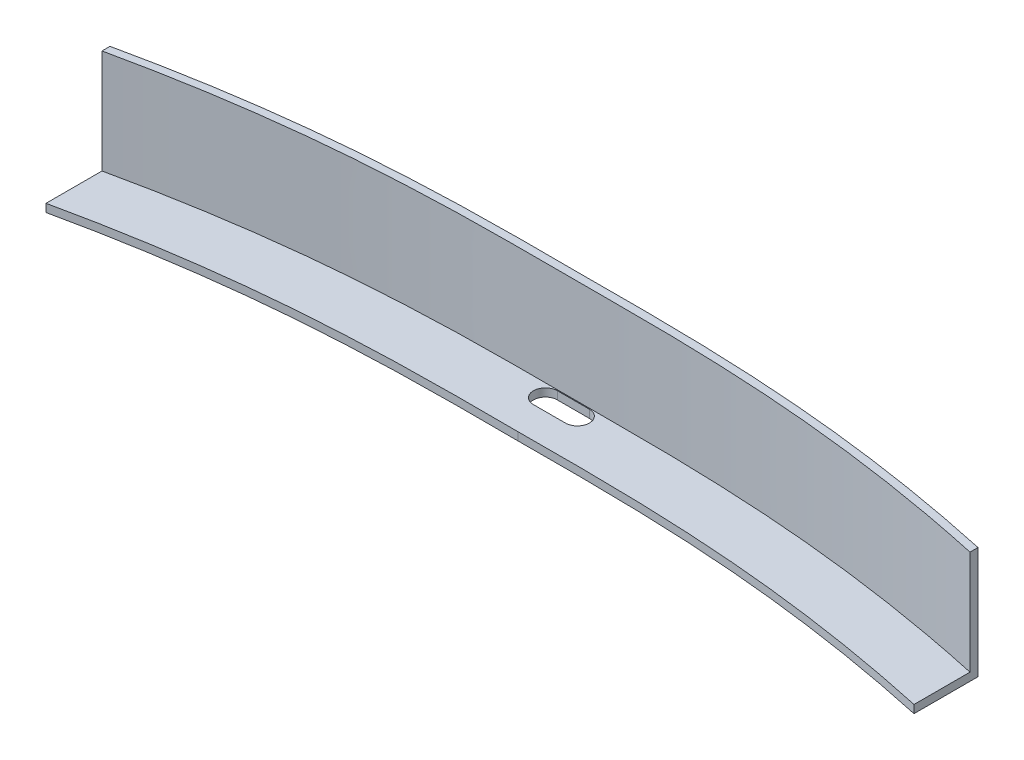
ISO-10303-21;
HEADER;
FILE_DESCRIPTION(('STEP AP214'),'2;1');
FILE_NAME('part.step','',(''),(''),'','','');
FILE_SCHEMA(('AUTOMOTIVE_DESIGN { 1 0 10303 214 1 1 1 1 }'));
ENDSEC;
DATA;
#1=APPLICATION_CONTEXT('core data for automotive mechanical design processes');
#2=APPLICATION_PROTOCOL_DEFINITION('international standard','automotive_design',2000,#1);
#3=PRODUCT_CONTEXT('',#1,'mechanical');
#4=PRODUCT('Part','Part','',(#3));
#5=PRODUCT_RELATED_PRODUCT_CATEGORY('part','',(#4));
#6=PRODUCT_DEFINITION_FORMATION('','',#4);
#7=PRODUCT_DEFINITION_CONTEXT('part definition',#1,'design');
#8=PRODUCT_DEFINITION('design','',#6,#7);
#9=PRODUCT_DEFINITION_SHAPE('','',#8);
#10=(LENGTH_UNIT() NAMED_UNIT(*) SI_UNIT(.MILLI.,.METRE.));
#11=(NAMED_UNIT(*) PLANE_ANGLE_UNIT() SI_UNIT($,.RADIAN.));
#12=(NAMED_UNIT(*) SI_UNIT($,.STERADIAN.) SOLID_ANGLE_UNIT());
#13=UNCERTAINTY_MEASURE_WITH_UNIT(LENGTH_MEASURE(1.E-05),#10,'distance_accuracy_value','');
#14=(GEOMETRIC_REPRESENTATION_CONTEXT(3) GLOBAL_UNCERTAINTY_ASSIGNED_CONTEXT((#13)) GLOBAL_UNIT_ASSIGNED_CONTEXT((#10,
#11,#12)) REPRESENTATION_CONTEXT('',''));
#15=CARTESIAN_POINT('',(0.,0.,0.));
#16=DIRECTION('',(0.,0.,1.));
#17=DIRECTION('',(1.,0.,0.));
#18=AXIS2_PLACEMENT_3D('',#15,#16,#17);
#19=CARTESIAN_POINT('',(0.,0.,0.));
#20=DIRECTION('',(0.,1.,0.));
#21=DIRECTION('',(0.,0.,1.));
#22=AXIS2_PLACEMENT_3D('',#19,#20,#21);
#23=PLANE('',#22);
#24=CARTESIAN_POINT('',(51.827852841315,0.,-2.04277027427121));
#25=CARTESIAN_POINT('',(43.4406782163176,0.,-3.87053409091254));
#26=CARTESIAN_POINT('',(30.1443444906021,0.,-5.93787877011409));
#27=CARTESIAN_POINT('',(11.9963198104847,0.,-6.86033235212055));
#28=CARTESIAN_POINT('',(2.72279196164812,0.,-6.84493417488937));
#29=CARTESIAN_POINT('',(-2.44151387951422,0.,-6.81770268280025));
#30=B_SPLINE_CURVE_WITH_KNOTS('',3,(#24,#25,#26,#27,#28,#29),.UNSPECIFIED.,.F.,.F.,(4,1,1,4),
(0.,0.47203113006856,0.735860592725768,1.),.UNSPECIFIED.);
#31=CARTESIAN_POINT('',(51.8278528413148,0.,-2.04277027427121));
#32=VERTEX_POINT('',#31);
#33=CARTESIAN_POINT('',(-2.44151387951423,0.,-6.81770268280025));
#34=VERTEX_POINT('',#33);
#35=EDGE_CURVE('E206',#32,#34,#30,.T.);
#36=ORIENTED_EDGE('',*,*,#35,.T.);
#37=CARTESIAN_POINT('',(-56.7108806003434,0.,-2.04277027427121));
#38=CARTESIAN_POINT('',(-48.323705975346,0.,-3.87053409091255));
#39=CARTESIAN_POINT('',(-35.0273722496306,0.,-5.93787877011409));
#40=CARTESIAN_POINT('',(-16.8793475695131,0.,-6.86033235212055));
#41=CARTESIAN_POINT('',(-7.60581972067667,0.,-6.84493417488936));
#42=CARTESIAN_POINT('',(-2.44151387951423,0.,-6.81770268280025));
#43=B_SPLINE_CURVE_WITH_KNOTS('',3,(#37,#38,#39,#40,#41,#42),.UNSPECIFIED.,.F.,.F.,(4,1,1,4),
(0.,0.47203113006856,0.735860592725768,1.),.UNSPECIFIED.);
#44=CARTESIAN_POINT('',(-56.7108806003434,0.,-2.04277027427121));
#45=VERTEX_POINT('',#44);
#46=EDGE_CURVE('E245',#45,#34,#43,.T.);
#47=ORIENTED_EDGE('',*,*,#46,.F.);
#48=DIRECTION('',(0.,0.,1.));
#49=VECTOR('',#48,1.);
#50=CARTESIAN_POINT('',(-56.7108806003434,0.,5.902661755244E-13));
#51=LINE('',#50,#49);
#52=CARTESIAN_POINT('',(-56.7108806003435,0.,-10.0427702742712));
#53=VERTEX_POINT('',#52);
#54=EDGE_CURVE('E238',#53,#45,#51,.T.);
#55=ORIENTED_EDGE('',*,*,#54,.F.);
#56=CARTESIAN_POINT('',(-56.7108806003435,0.,-10.0427702742712));
#57=CARTESIAN_POINT('',(-48.3237059753461,0.,-11.8705340909125));
#58=CARTESIAN_POINT('',(-35.0273722496307,0.,-13.9378787701141));
#59=CARTESIAN_POINT('',(-16.8793475695132,0.,-14.8603323521206));
#60=CARTESIAN_POINT('',(-7.60581972067676,0.,-14.8449341748894));
#61=CARTESIAN_POINT('',(-2.44151387951431,0.,-14.8177026828002));
#62=B_SPLINE_CURVE_WITH_KNOTS('',3,(#56,#57,#58,#59,#60,#61),.UNSPECIFIED.,.F.,.F.,(4,1,1,4),
(0.,0.47203113006856,0.735860592725768,1.),.UNSPECIFIED.);
#63=CARTESIAN_POINT('',(-2.44151387951431,0.,-14.8177026828002));
#64=VERTEX_POINT('',#63);
#65=EDGE_CURVE('E229',#53,#64,#62,.T.);
#66=ORIENTED_EDGE('',*,*,#65,.T.);
#67=CARTESIAN_POINT('',(51.8278528413148,0.,-10.0427702742712));
#68=CARTESIAN_POINT('',(43.4406782163175,0.,-11.8705340909125));
#69=CARTESIAN_POINT('',(30.144344490602,0.,-13.9378787701141));
#70=CARTESIAN_POINT('',(11.9963198104846,0.,-14.8603323521206));
#71=CARTESIAN_POINT('',(2.72279196164803,0.,-14.8449341748894));
#72=CARTESIAN_POINT('',(-2.4415138795143,0.,-14.8177026828002));
#73=B_SPLINE_CURVE_WITH_KNOTS('',3,(#67,#68,#69,#70,#71,#72),.UNSPECIFIED.,.F.,.F.,(4,1,1,4),
(0.,0.47203113006856,0.735860592725768,1.),.UNSPECIFIED.);
#74=CARTESIAN_POINT('',(51.8278528413149,0.,-10.0427702742712));
#75=VERTEX_POINT('',#74);
#76=EDGE_CURVE('E223',#75,#64,#73,.T.);
#77=ORIENTED_EDGE('',*,*,#76,.F.);
#78=DIRECTION('',(0.,0.,1.));
#79=VECTOR('',#78,1.);
#80=CARTESIAN_POINT('',(51.8278528413148,0.,5.394419581998E-13));
#81=LINE('',#80,#79);
#82=EDGE_CURVE('E215',#75,#32,#81,.T.);
#83=ORIENTED_EDGE('',*,*,#82,.T.);
#84=EDGE_LOOP('',(#36,#47,#55,#66,#77,#83));
#85=FACE_BOUND('',#84,.T.);
#86=CARTESIAN_POINT('',(-4.44151387951423,0.,-12.2177026828002));
#87=DIRECTION('',(0.,1.,0.));
#88=DIRECTION('',(0.,0.,1.));
#89=AXIS2_PLACEMENT_3D('',#86,#87,#88);
#90=CIRCLE('',#89,1.5);
#91=CARTESIAN_POINT('',(-4.44151387951423,0.,-10.7177026828002));
#92=VERTEX_POINT('',#91);
#93=CARTESIAN_POINT('',(-4.44151387951423,0.,-13.7177026828002));
#94=VERTEX_POINT('',#93);
#95=EDGE_CURVE('E153',#92,#94,#90,.F.);
#96=ORIENTED_EDGE('',*,*,#95,.F.);
#97=DIRECTION('',(-1.,0.,0.));
#98=VECTOR('',#97,1.);
#99=CARTESIAN_POINT('',(0.,0.,-10.7177026828002));
#100=LINE('',#99,#98);
#101=CARTESIAN_POINT('',(-0.441513879514229,0.,-10.7177026828002));
#102=VERTEX_POINT('',#101);
#103=EDGE_CURVE('E149',#102,#92,#100,.T.);
#104=ORIENTED_EDGE('',*,*,#103,.F.);
#105=CARTESIAN_POINT('',(-0.441513879514229,0.,-12.2177026828002));
#106=DIRECTION('',(0.,1.,0.));
#107=DIRECTION('',(0.,0.,1.));
#108=AXIS2_PLACEMENT_3D('',#105,#106,#107);
#109=CIRCLE('',#108,1.5);
#110=CARTESIAN_POINT('',(-0.441513879514229,0.,-13.7177026828002));
#111=VERTEX_POINT('',#110);
#112=EDGE_CURVE('E135',#111,#102,#109,.F.);
#113=ORIENTED_EDGE('',*,*,#112,.F.);
#114=DIRECTION('',(1.,0.,0.));
#115=VECTOR('',#114,1.);
#116=CARTESIAN_POINT('',(0.,0.,-13.7177026828002));
#117=LINE('',#116,#115);
#118=EDGE_CURVE('E129',#94,#111,#117,.T.);
#119=ORIENTED_EDGE('',*,*,#118,.F.);
#120=EDGE_LOOP('',(#96,#104,#113,#119));
#121=FACE_BOUND('',#120,.T.);
#122=ADVANCED_FACE('F41',(#85,#121),#23,.F.);
#123=CARTESIAN_POINT('',(0.,1.,0.));
#124=DIRECTION('',(0.,1.,0.));
#125=DIRECTION('',(0.,0.,1.));
#126=AXIS2_PLACEMENT_3D('',#123,#124,#125);
#127=PLANE('',#126);
#128=CARTESIAN_POINT('',(-56.7108806003435,0.999999999999999,-9.04277027427121));
#129=CARTESIAN_POINT('',(-51.0152638595637,0.999999999999999,-10.2833874997117));
#130=CARTESIAN_POINT('',(-42.2215274908545,0.999999999999999,-11.8261273436064));
#131=CARTESIAN_POINT('',(-30.4782510758473,0.999999999999999,-13.0861810499157));
#132=CARTESIAN_POINT('',(-21.96075596933,0.999999999999999,-13.6060391619829));
#133=CARTESIAN_POINT('',(-12.6802550836418,0.999999999999999,-13.8661026620474));
#134=CARTESIAN_POINT('',(-2.48825539649043,0.999999999999999,-13.7888162008623));
#135=CARTESIAN_POINT('',(7.83960120773843,0.999999999999999,-13.866738732467));
#136=CARTESIAN_POINT('',(17.1432043535183,0.999999999999999,-13.6045901310021));
#137=CARTESIAN_POINT('',(25.5946669040185,0.999999999999999,-13.0816954915766));
#138=CARTESIAN_POINT('',(37.249642077741,0.999999999999999,-11.8392111677853));
#139=CARTESIAN_POINT('',(46.0225393831475,0.999999999999999,-10.3073170950866));
#140=CARTESIAN_POINT('',(51.8278528413149,0.999999999999999,-9.04277027427121));
#141=B_SPLINE_CURVE_WITH_KNOTS('',3,(#128,#129,#130,#131,#132,#133,#134,#135,#136,#137,#138,
#139,#140),.UNSPECIFIED.,.F.,.F.,(4,1,1,1,1,1,1,1,1,1,4),(0.,0.160113822027446,0.24501196644569,
0.324303490281267,0.394459253627526,0.499999871236472,0.604256140418702,0.678146052397053,
0.755618705086474,0.836798939280945,1.),.UNSPECIFIED.);
#142=CARTESIAN_POINT('',(-56.7108806003435,1.,-9.04277027427113));
#143=VERTEX_POINT('',#142);
#144=CARTESIAN_POINT('',(51.8278528413149,1.,-9.04277027427124));
#145=VERTEX_POINT('',#144);
#146=EDGE_CURVE('E160',#143,#145,#141,.T.);
#147=ORIENTED_EDGE('',*,*,#146,.F.);
#148=DIRECTION('',(0.,0.,1.));
#149=VECTOR('',#148,1.);
#150=CARTESIAN_POINT('',(-56.7108806003434,1.,5.902661755244E-13));
#151=LINE('',#150,#149);
#152=CARTESIAN_POINT('',(-56.7108806003434,1.,-2.04277027427121));
#153=VERTEX_POINT('',#152);
#154=EDGE_CURVE('E438',#143,#153,#151,.T.);
#155=ORIENTED_EDGE('',*,*,#154,.T.);
#156=CARTESIAN_POINT('',(-56.7108806003434,1.,-2.04277027427121));
#157=CARTESIAN_POINT('',(-48.323705975346,1.,-3.87053409091255));
#158=CARTESIAN_POINT('',(-35.0273722496306,1.,-5.93787877011409));
#159=CARTESIAN_POINT('',(-16.8793475695131,1.,-6.86033235212055));
#160=CARTESIAN_POINT('',(-7.60581972067667,1.,-6.84493417488936));
#161=CARTESIAN_POINT('',(-2.44151387951423,1.,-6.81770268280025));
#162=B_SPLINE_CURVE_WITH_KNOTS('',3,(#156,#157,#158,#159,#160,#161),.UNSPECIFIED.,.F.,.F.,(4,1,
1,4),(0.,0.47203113006856,0.735860592725768,1.),.UNSPECIFIED.);
#163=CARTESIAN_POINT('',(-2.44151387951423,1.,-6.81770268280025));
#164=VERTEX_POINT('',#163);
#165=EDGE_CURVE('E273',#153,#164,#162,.T.);
#166=ORIENTED_EDGE('',*,*,#165,.T.);
#167=CARTESIAN_POINT('',(51.827852841315,1.,-2.04277027427121));
#168=CARTESIAN_POINT('',(43.4406782163176,1.,-3.87053409091254));
#169=CARTESIAN_POINT('',(30.1443444906021,1.,-5.93787877011409));
#170=CARTESIAN_POINT('',(11.9963198104847,1.,-6.86033235212055));
#171=CARTESIAN_POINT('',(2.72279196164812,1.,-6.84493417488937));
#172=CARTESIAN_POINT('',(-2.44151387951422,1.,-6.81770268280025));
#173=B_SPLINE_CURVE_WITH_KNOTS('',3,(#167,#168,#169,#170,#171,#172),.UNSPECIFIED.,.F.,.F.,(4,1,
1,4),(0.,0.47203113006856,0.735860592725768,1.),.UNSPECIFIED.);
#174=CARTESIAN_POINT('',(51.827852841315,1.,-2.04277027427121));
#175=VERTEX_POINT('',#174);
#176=EDGE_CURVE('E443',#175,#164,#173,.T.);
#177=ORIENTED_EDGE('',*,*,#176,.F.);
#178=DIRECTION('',(0.,0.,1.));
#179=VECTOR('',#178,1.);
#180=CARTESIAN_POINT('',(51.8278528413148,1.,5.394419581998E-13));
#181=LINE('',#180,#179);
#182=EDGE_CURVE('E216',#145,#175,#181,.T.);
#183=ORIENTED_EDGE('',*,*,#182,.F.);
#184=EDGE_LOOP('',(#147,#155,#166,#177,#183));
#185=FACE_BOUND('',#184,.T.);
#186=DIRECTION('',(-1.,0.,0.));
#187=VECTOR('',#186,1.);
#188=CARTESIAN_POINT('',(0.,1.,-10.7177026828002));
#189=LINE('',#188,#187);
#190=CARTESIAN_POINT('',(-0.441513879514229,1.,-10.7177026828002));
#191=VERTEX_POINT('',#190);
#192=CARTESIAN_POINT('',(-4.44151387951423,1.,-10.7177026828002));
#193=VERTEX_POINT('',#192);
#194=EDGE_CURVE('E51',#191,#193,#189,.T.);
#195=ORIENTED_EDGE('',*,*,#194,.T.);
#196=CARTESIAN_POINT('',(-4.44151387951423,1.,-12.2177026828002));
#197=DIRECTION('',(0.,1.,0.));
#198=DIRECTION('',(0.,0.,1.));
#199=AXIS2_PLACEMENT_3D('',#196,#197,#198);
#200=CIRCLE('',#199,1.5);
#201=CARTESIAN_POINT('',(-4.44151387951423,1.,-13.7177026828002));
#202=VERTEX_POINT('',#201);
#203=EDGE_CURVE('E11',#193,#202,#200,.F.);
#204=ORIENTED_EDGE('',*,*,#203,.T.);
#205=DIRECTION('',(1.,0.,0.));
#206=VECTOR('',#205,1.);
#207=CARTESIAN_POINT('',(0.,1.,-13.7177026828002));
#208=LINE('',#207,#206);
#209=CARTESIAN_POINT('',(-0.441513879514229,1.,-13.7177026828002));
#210=VERTEX_POINT('',#209);
#211=EDGE_CURVE('E278',#202,#210,#208,.T.);
#212=ORIENTED_EDGE('',*,*,#211,.T.);
#213=CARTESIAN_POINT('',(-0.441513879514229,1.,-12.2177026828002));
#214=DIRECTION('',(0.,1.,0.));
#215=DIRECTION('',(0.,0.,1.));
#216=AXIS2_PLACEMENT_3D('',#213,#214,#215);
#217=CIRCLE('',#216,1.5);
#218=EDGE_CURVE('E143',#210,#191,#217,.F.);
#219=ORIENTED_EDGE('',*,*,#218,.T.);
#220=EDGE_LOOP('',(#195,#204,#212,#219));
#221=FACE_BOUND('',#220,.T.);
#222=ADVANCED_FACE('F182',(#185,#221),#127,.T.);
#223=CARTESIAN_POINT('',(51.827852841315,14.,-2.04277027427121));
#224=CARTESIAN_POINT('',(43.4406782163176,14.,-3.87053409091254));
#225=CARTESIAN_POINT('',(30.1443444906021,14.,-5.93787877011409));
#226=CARTESIAN_POINT('',(11.9963198104847,14.,-6.86033235212055));
#227=CARTESIAN_POINT('',(2.72279196164812,14.,-6.84493417488937));
#228=CARTESIAN_POINT('',(-2.44151387951422,14.,-6.81770268280025));
#229=B_SPLINE_CURVE_WITH_KNOTS('',3,(#223,#224,#225,#226,#227,#228),.UNSPECIFIED.,.F.,.F.,(4,1,
1,4),(0.,0.47203113006856,0.735860592725768,1.),.UNSPECIFIED.);
#230=DIRECTION('',(0.,-1.,0.));
#231=VECTOR('',#230,1.);
#232=SURFACE_OF_LINEAR_EXTRUSION('',#229,#231);
#233=DIRECTION('',(0.,-1.,0.));
#234=VECTOR('',#233,1.);
#235=CARTESIAN_POINT('',(51.8278528413148,14.,-2.04277027427121));
#236=LINE('',#235,#234);
#237=EDGE_CURVE('E270',#175,#32,#236,.T.);
#238=ORIENTED_EDGE('',*,*,#237,.F.);
#239=ORIENTED_EDGE('',*,*,#176,.T.);
#240=DIRECTION('',(0.,-1.,0.));
#241=VECTOR('',#240,1.);
#242=CARTESIAN_POINT('',(-2.44151387951423,14.,-6.81770268280025));
#243=LINE('',#242,#241);
#244=EDGE_CURVE('E252',#164,#34,#243,.T.);
#245=ORIENTED_EDGE('',*,*,#244,.T.);
#246=ORIENTED_EDGE('',*,*,#35,.F.);
#247=EDGE_LOOP('',(#238,#239,#245,#246));
#248=FACE_BOUND('',#247,.T.);
#249=ADVANCED_FACE('F43',(#248),#232,.T.);
#250=CARTESIAN_POINT('',(51.8278528413148,14.,5.394419581998E-13));
#251=DIRECTION('',(1.,0.,0.));
#252=DIRECTION('',(0.,0.,-1.));
#253=AXIS2_PLACEMENT_3D('',#250,#251,#252);
#254=PLANE('',#253);
#255=DIRECTION('',(0.,0.,1.));
#256=VECTOR('',#255,1.);
#257=CARTESIAN_POINT('',(51.8278528413148,14.,5.394419581998E-13));
#258=LINE('',#257,#256);
#259=CARTESIAN_POINT('',(51.8278528413149,14.,-10.0427702742712));
#260=VERTEX_POINT('',#259);
#261=CARTESIAN_POINT('',(51.8278528413149,14.,-9.04277027427121));
#262=VERTEX_POINT('',#261);
#263=EDGE_CURVE('E251',#260,#262,#258,.T.);
#264=ORIENTED_EDGE('',*,*,#263,.T.);
#265=DIRECTION('',(0.,1.,0.));
#266=VECTOR('',#265,1.);
#267=CARTESIAN_POINT('',(51.8278528413149,1.,-9.04277027427124));
#268=LINE('',#267,#266);
#269=EDGE_CURVE('E167',#145,#262,#268,.T.);
#270=ORIENTED_EDGE('',*,*,#269,.F.);
#271=ORIENTED_EDGE('',*,*,#182,.T.);
#272=ORIENTED_EDGE('',*,*,#237,.T.);
#273=ORIENTED_EDGE('',*,*,#82,.F.);
#274=DIRECTION('',(0.,-1.,0.));
#275=VECTOR('',#274,1.);
#276=CARTESIAN_POINT('',(51.8278528413149,14.,-10.0427702742712));
#277=LINE('',#276,#275);
#278=EDGE_CURVE('E267',#260,#75,#277,.T.);
#279=ORIENTED_EDGE('',*,*,#278,.F.);
#280=EDGE_LOOP('',(#264,#270,#271,#272,#273,#279));
#281=FACE_BOUND('',#280,.T.);
#282=ADVANCED_FACE('F372',(#281),#254,.T.);
#283=CARTESIAN_POINT('',(-56.7108806003434,14.,5.902661755244E-13));
#284=DIRECTION('',(1.,0.,0.));
#285=DIRECTION('',(0.,0.,-1.));
#286=AXIS2_PLACEMENT_3D('',#283,#284,#285);
#287=PLANE('',#286);
#288=DIRECTION('',(0.,1.,0.));
#289=VECTOR('',#288,1.);
#290=CARTESIAN_POINT('',(-56.7108806003435,1.,-9.04277027427113));
#291=LINE('',#290,#289);
#292=CARTESIAN_POINT('',(-56.7108806003435,14.,-9.04277027427113));
#293=VERTEX_POINT('',#292);
#294=EDGE_CURVE('E436',#143,#293,#291,.T.);
#295=ORIENTED_EDGE('',*,*,#294,.T.);
#296=DIRECTION('',(0.,0.,1.));
#297=VECTOR('',#296,1.);
#298=CARTESIAN_POINT('',(-56.7108806003434,14.,5.902661755244E-13));
#299=LINE('',#298,#297);
#300=CARTESIAN_POINT('',(-56.7108806003435,14.,-10.0427702742712));
#301=VERTEX_POINT('',#300);
#302=EDGE_CURVE('E204',#301,#293,#299,.T.);
#303=ORIENTED_EDGE('',*,*,#302,.F.);
#304=DIRECTION('',(0.,-1.,0.));
#305=VECTOR('',#304,1.);
#306=CARTESIAN_POINT('',(-56.7108806003435,14.,-10.0427702742712));
#307=LINE('',#306,#305);
#308=EDGE_CURVE('E261',#301,#53,#307,.T.);
#309=ORIENTED_EDGE('',*,*,#308,.T.);
#310=ORIENTED_EDGE('',*,*,#54,.T.);
#311=DIRECTION('',(0.,-1.,0.));
#312=VECTOR('',#311,1.);
#313=CARTESIAN_POINT('',(-56.7108806003434,14.,-2.04277027427121));
#314=LINE('',#313,#312);
#315=EDGE_CURVE('E258',#153,#45,#314,.T.);
#316=ORIENTED_EDGE('',*,*,#315,.F.);
#317=ORIENTED_EDGE('',*,*,#154,.F.);
#318=EDGE_LOOP('',(#295,#303,#309,#310,#316,#317));
#319=FACE_BOUND('',#318,.T.);
#320=ADVANCED_FACE('F196',(#319),#287,.F.);
#321=CARTESIAN_POINT('',(-56.7108806003434,14.,-2.04277027427121));
#322=CARTESIAN_POINT('',(-48.323705975346,14.,-3.87053409091255));
#323=CARTESIAN_POINT('',(-35.0273722496306,14.,-5.93787877011409));
#324=CARTESIAN_POINT('',(-16.8793475695131,14.,-6.86033235212055));
#325=CARTESIAN_POINT('',(-7.60581972067667,14.,-6.84493417488936));
#326=CARTESIAN_POINT('',(-2.44151387951423,14.,-6.81770268280025));
#327=B_SPLINE_CURVE_WITH_KNOTS('',3,(#321,#322,#323,#324,#325,#326),.UNSPECIFIED.,.F.,.F.,(4,1,
1,4),(0.,0.47203113006856,0.735860592725768,1.),.UNSPECIFIED.);
#328=DIRECTION('',(0.,-1.,0.));
#329=VECTOR('',#328,1.);
#330=SURFACE_OF_LINEAR_EXTRUSION('',#327,#329);
#331=ORIENTED_EDGE('',*,*,#165,.F.);
#332=ORIENTED_EDGE('',*,*,#315,.T.);
#333=ORIENTED_EDGE('',*,*,#46,.T.);
#334=ORIENTED_EDGE('',*,*,#244,.F.);
#335=EDGE_LOOP('',(#331,#332,#333,#334));
#336=FACE_BOUND('',#335,.T.);
#337=ADVANCED_FACE('F188',(#336),#330,.F.);
#338=CARTESIAN_POINT('',(0.,14.,0.));
#339=DIRECTION('',(0.,1.,0.));
#340=DIRECTION('',(0.,0.,1.));
#341=AXIS2_PLACEMENT_3D('',#338,#339,#340);
#342=PLANE('',#341);
#343=ORIENTED_EDGE('',*,*,#302,.T.);
#344=CARTESIAN_POINT('',(-56.7108806003435,14.,-9.04277027427121));
#345=CARTESIAN_POINT('',(-51.0152638595637,14.,-10.2833874997117));
#346=CARTESIAN_POINT('',(-42.2215274908545,14.,-11.8261273436064));
#347=CARTESIAN_POINT('',(-30.4782510758473,14.,-13.0861810499157));
#348=CARTESIAN_POINT('',(-21.96075596933,14.,-13.6060391619829));
#349=CARTESIAN_POINT('',(-12.6802550836418,14.,-13.8661026620474));
#350=CARTESIAN_POINT('',(-2.48825539649043,14.,-13.7888162008623));
#351=CARTESIAN_POINT('',(7.83960120773843,14.,-13.866738732467));
#352=CARTESIAN_POINT('',(17.1432043535183,14.,-13.6045901310021));
#353=CARTESIAN_POINT('',(25.5946669040185,14.,-13.0816954915766));
#354=CARTESIAN_POINT('',(37.249642077741,14.,-11.8392111677853));
#355=CARTESIAN_POINT('',(46.0225393831475,14.,-10.3073170950866));
#356=CARTESIAN_POINT('',(51.8278528413149,14.,-9.04277027427121));
#357=B_SPLINE_CURVE_WITH_KNOTS('',3,(#344,#345,#346,#347,#348,#349,#350,#351,#352,#353,#354,
#355,#356),.UNSPECIFIED.,.F.,.F.,(4,1,1,1,1,1,1,1,1,1,4),(0.,0.160113822027446,0.24501196644569,
0.324303490281267,0.394459253627526,0.499999871236472,0.604256140418702,0.678146052397053,
0.755618705086474,0.836798939280945,1.),.UNSPECIFIED.);
#358=EDGE_CURVE('E159',#293,#262,#357,.T.);
#359=ORIENTED_EDGE('',*,*,#358,.T.);
#360=ORIENTED_EDGE('',*,*,#263,.F.);
#361=CARTESIAN_POINT('',(51.8278528413148,14.,-10.0427702742712));
#362=CARTESIAN_POINT('',(43.4406782163175,14.,-11.8705340909125));
#363=CARTESIAN_POINT('',(30.144344490602,14.,-13.9378787701141));
#364=CARTESIAN_POINT('',(11.9963198104846,14.,-14.8603323521206));
#365=CARTESIAN_POINT('',(2.72279196164803,14.,-14.8449341748894));
#366=CARTESIAN_POINT('',(-2.4415138795143,14.,-14.8177026828002));
#367=B_SPLINE_CURVE_WITH_KNOTS('',3,(#361,#362,#363,#364,#365,#366),.UNSPECIFIED.,.F.,.F.,(4,1,
1,4),(0.,0.47203113006856,0.735860592725768,1.),.UNSPECIFIED.);
#368=CARTESIAN_POINT('',(-2.44151387951431,14.,-14.8177026828002));
#369=VERTEX_POINT('',#368);
#370=EDGE_CURVE('E408',#260,#369,#367,.T.);
#371=ORIENTED_EDGE('',*,*,#370,.T.);
#372=CARTESIAN_POINT('',(-56.7108806003435,14.,-10.0427702742712));
#373=CARTESIAN_POINT('',(-48.3237059753461,14.,-11.8705340909125));
#374=CARTESIAN_POINT('',(-35.0273722496307,14.,-13.9378787701141));
#375=CARTESIAN_POINT('',(-16.8793475695132,14.,-14.8603323521206));
#376=CARTESIAN_POINT('',(-7.60581972067676,14.,-14.8449341748894));
#377=CARTESIAN_POINT('',(-2.44151387951431,14.,-14.8177026828002));
#378=B_SPLINE_CURVE_WITH_KNOTS('',3,(#372,#373,#374,#375,#376,#377),.UNSPECIFIED.,.F.,.F.,(4,1,
1,4),(0.,0.47203113006856,0.735860592725768,1.),.UNSPECIFIED.);
#379=EDGE_CURVE('E414',#301,#369,#378,.T.);
#380=ORIENTED_EDGE('',*,*,#379,.F.);
#381=EDGE_LOOP('',(#343,#359,#360,#371,#380));
#382=FACE_BOUND('',#381,.T.);
#383=ADVANCED_FACE('F184',(#382),#342,.T.);
#384=DIRECTION('',(0.,-1.,0.));
#385=VECTOR('',#384,1.);
#386=SURFACE_OF_LINEAR_EXTRUSION('',#367,#385);
#387=ORIENTED_EDGE('',*,*,#76,.T.);
#388=DIRECTION('',(0.,-1.,0.));
#389=VECTOR('',#388,1.);
#390=CARTESIAN_POINT('',(-2.44151387951431,14.,-14.8177026828002));
#391=LINE('',#390,#389);
#392=EDGE_CURVE('E264',#369,#64,#391,.T.);
#393=ORIENTED_EDGE('',*,*,#392,.F.);
#394=ORIENTED_EDGE('',*,*,#370,.F.);
#395=ORIENTED_EDGE('',*,*,#278,.T.);
#396=EDGE_LOOP('',(#387,#393,#394,#395));
#397=FACE_BOUND('',#396,.T.);
#398=ADVANCED_FACE('F187',(#397),#386,.F.);
#399=DIRECTION('',(0.,-1.,0.));
#400=VECTOR('',#399,1.);
#401=SURFACE_OF_LINEAR_EXTRUSION('',#378,#400);
#402=ORIENTED_EDGE('',*,*,#65,.F.);
#403=ORIENTED_EDGE('',*,*,#308,.F.);
#404=ORIENTED_EDGE('',*,*,#379,.T.);
#405=ORIENTED_EDGE('',*,*,#392,.T.);
#406=EDGE_LOOP('',(#402,#403,#404,#405));
#407=FACE_BOUND('',#406,.T.);
#408=ADVANCED_FACE('F180',(#407),#401,.T.);
#409=DIRECTION('',(0.,1.,0.));
#410=VECTOR('',#409,1.);
#411=SURFACE_OF_LINEAR_EXTRUSION('',#141,#410);
#412=ORIENTED_EDGE('',*,*,#358,.F.);
#413=ORIENTED_EDGE('',*,*,#294,.F.);
#414=ORIENTED_EDGE('',*,*,#146,.T.);
#415=ORIENTED_EDGE('',*,*,#269,.T.);
#416=EDGE_LOOP('',(#412,#413,#414,#415));
#417=FACE_BOUND('',#416,.T.);
#418=ADVANCED_FACE('F175',(#417),#411,.T.);
#419=CARTESIAN_POINT('',(-4.44151387951423,9.,-12.2177026828002));
#420=DIRECTION('',(0.,-1.,0.));
#421=DIRECTION('',(0.,0.,-1.));
#422=AXIS2_PLACEMENT_3D('',#419,#420,#421);
#423=CYLINDRICAL_SURFACE('',#422,1.5);
#424=ORIENTED_EDGE('',*,*,#95,.T.);
#425=DIRECTION('',(0.,-1.,0.));
#426=VECTOR('',#425,1.);
#427=CARTESIAN_POINT('',(-4.44151387951423,9.,-13.7177026828002));
#428=LINE('',#427,#426);
#429=EDGE_CURVE('E58',#202,#94,#428,.T.);
#430=ORIENTED_EDGE('',*,*,#429,.F.);
#431=ORIENTED_EDGE('',*,*,#203,.F.);
#432=DIRECTION('',(0.,-1.,0.));
#433=VECTOR('',#432,1.);
#434=CARTESIAN_POINT('',(-4.44151387951423,9.,-10.7177026828002));
#435=LINE('',#434,#433);
#436=EDGE_CURVE('E136',#193,#92,#435,.T.);
#437=ORIENTED_EDGE('',*,*,#436,.T.);
#438=EDGE_LOOP('',(#424,#430,#431,#437));
#439=FACE_BOUND('',#438,.T.);
#440=ADVANCED_FACE('F179',(#439),#423,.F.);
#441=CARTESIAN_POINT('',(-4.44151387951423,9.,-10.7177026828002));
#442=DIRECTION('',(0.,0.,-1.));
#443=DIRECTION('',(-1.,0.,0.));
#444=AXIS2_PLACEMENT_3D('',#441,#442,#443);
#445=PLANE('',#444);
#446=ORIENTED_EDGE('',*,*,#103,.T.);
#447=ORIENTED_EDGE('',*,*,#436,.F.);
#448=ORIENTED_EDGE('',*,*,#194,.F.);
#449=DIRECTION('',(0.,-1.,0.));
#450=VECTOR('',#449,1.);
#451=CARTESIAN_POINT('',(-0.441513879514229,9.,-10.7177026828002));
#452=LINE('',#451,#450);
#453=EDGE_CURVE('E146',#191,#102,#452,.T.);
#454=ORIENTED_EDGE('',*,*,#453,.T.);
#455=EDGE_LOOP('',(#446,#447,#448,#454));
#456=FACE_BOUND('',#455,.T.);
#457=ADVANCED_FACE('F290',(#456),#445,.T.);
#458=CARTESIAN_POINT('',(-0.441513879514229,9.,-12.2177026828002));
#459=DIRECTION('',(0.,-1.,0.));
#460=DIRECTION('',(0.,0.,-1.));
#461=AXIS2_PLACEMENT_3D('',#458,#459,#460);
#462=CYLINDRICAL_SURFACE('',#461,1.5);
#463=ORIENTED_EDGE('',*,*,#112,.T.);
#464=ORIENTED_EDGE('',*,*,#453,.F.);
#465=ORIENTED_EDGE('',*,*,#218,.F.);
#466=DIRECTION('',(0.,-1.,0.));
#467=VECTOR('',#466,1.);
#468=CARTESIAN_POINT('',(-0.441513879514229,9.,-13.7177026828002));
#469=LINE('',#468,#467);
#470=EDGE_CURVE('E63',#210,#111,#469,.T.);
#471=ORIENTED_EDGE('',*,*,#470,.T.);
#472=EDGE_LOOP('',(#463,#464,#465,#471));
#473=FACE_BOUND('',#472,.T.);
#474=ADVANCED_FACE('F139',(#473),#462,.F.);
#475=CARTESIAN_POINT('',(-4.44151387951423,9.,-13.7177026828002));
#476=DIRECTION('',(0.,0.,1.));
#477=DIRECTION('',(1.,0.,0.));
#478=AXIS2_PLACEMENT_3D('',#475,#476,#477);
#479=PLANE('',#478);
#480=ORIENTED_EDGE('',*,*,#118,.T.);
#481=ORIENTED_EDGE('',*,*,#470,.F.);
#482=ORIENTED_EDGE('',*,*,#211,.F.);
#483=ORIENTED_EDGE('',*,*,#429,.T.);
#484=EDGE_LOOP('',(#480,#481,#482,#483));
#485=FACE_BOUND('',#484,.T.);
#486=ADVANCED_FACE('F130',(#485),#479,.T.);
#487=CLOSED_SHELL('',(#122,#222,#249,#282,#320,#337,#383,#398,#408,#418,#440,#457,#474,#486));
#488=MANIFOLD_SOLID_BREP('B2',#487);
#489=ADVANCED_BREP_SHAPE_REPRESENTATION('',(#18,#488),#14);
#490=SHAPE_DEFINITION_REPRESENTATION(#9,#489);
ENDSEC;
END-ISO-10303-21;
